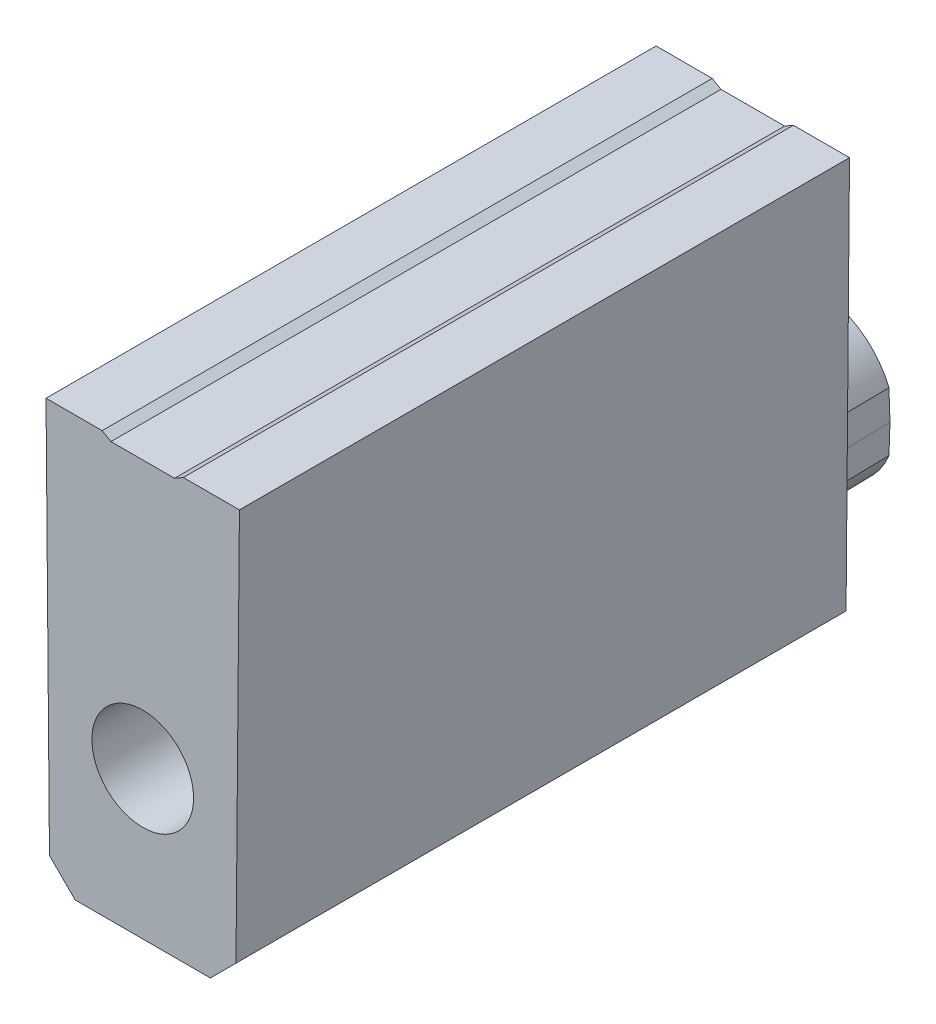
ISO-10303-21;
HEADER;
FILE_DESCRIPTION(('STEP AP214'),'2;1');
FILE_NAME('part.step','',(''),(''),'','','');
FILE_SCHEMA(('AUTOMOTIVE_DESIGN { 1 0 10303 214 1 1 1 1 }'));
ENDSEC;
DATA;
#1=APPLICATION_CONTEXT('core data for automotive mechanical design processes');
#2=APPLICATION_PROTOCOL_DEFINITION('international standard','automotive_design',2000,#1);
#3=PRODUCT_CONTEXT('',#1,'mechanical');
#4=PRODUCT('Part','Part','',(#3));
#5=PRODUCT_RELATED_PRODUCT_CATEGORY('part','',(#4));
#6=PRODUCT_DEFINITION_FORMATION('','',#4);
#7=PRODUCT_DEFINITION_CONTEXT('part definition',#1,'design');
#8=PRODUCT_DEFINITION('design','',#6,#7);
#9=PRODUCT_DEFINITION_SHAPE('','',#8);
#10=(LENGTH_UNIT() NAMED_UNIT(*) SI_UNIT(.MILLI.,.METRE.));
#11=(NAMED_UNIT(*) PLANE_ANGLE_UNIT() SI_UNIT($,.RADIAN.));
#12=(NAMED_UNIT(*) SI_UNIT($,.STERADIAN.) SOLID_ANGLE_UNIT());
#13=UNCERTAINTY_MEASURE_WITH_UNIT(LENGTH_MEASURE(1.E-05),#10,'distance_accuracy_value','');
#14=(GEOMETRIC_REPRESENTATION_CONTEXT(3) GLOBAL_UNCERTAINTY_ASSIGNED_CONTEXT((#13)) GLOBAL_UNIT_ASSIGNED_CONTEXT((#10,
#11,#12)) REPRESENTATION_CONTEXT('',''));
#15=CARTESIAN_POINT('',(0.,0.,0.));
#16=DIRECTION('',(0.,0.,1.));
#17=DIRECTION('',(1.,0.,0.));
#18=AXIS2_PLACEMENT_3D('',#15,#16,#17);
#19=CARTESIAN_POINT('',(2.41564658849859,10.4902,15.24));
#20=DIRECTION('',(0.,-1.,0.));
#21=DIRECTION('',(0.,0.,-1.));
#22=AXIS2_PLACEMENT_3D('',#19,#20,#21);
#23=PLANE('',#22);
#24=DIRECTION('',(-1.,0.,0.));
#25=VECTOR('',#24,1.);
#26=CARTESIAN_POINT('',(2.41564658849859,10.4902,15.24));
#27=LINE('',#26,#25);
#28=CARTESIAN_POINT('',(-1.01372045256125,10.4902,15.24));
#29=VERTEX_POINT('',#28);
#30=CARTESIAN_POINT('',(-2.41564658849859,10.4902,15.24));
#31=VERTEX_POINT('',#30);
#32=EDGE_CURVE('E180',#29,#31,#27,.T.);
#33=ORIENTED_EDGE('',*,*,#32,.F.);
#34=DIRECTION('',(0.,0.,-1.));
#35=VECTOR('',#34,1.);
#36=CARTESIAN_POINT('',(-1.01372045256125,10.4902,15.24));
#37=LINE('',#36,#35);
#38=CARTESIAN_POINT('',(-1.01372045256125,10.4902,0.));
#39=VERTEX_POINT('',#38);
#40=EDGE_CURVE('E239',#29,#39,#37,.T.);
#41=ORIENTED_EDGE('',*,*,#40,.T.);
#42=DIRECTION('',(-1.,0.,0.));
#43=VECTOR('',#42,1.);
#44=CARTESIAN_POINT('',(2.41564658849859,10.4902,0.));
#45=LINE('',#44,#43);
#46=CARTESIAN_POINT('',(-2.41564658849859,10.4902,0.));
#47=VERTEX_POINT('',#46);
#48=EDGE_CURVE('E188',#39,#47,#45,.T.);
#49=ORIENTED_EDGE('',*,*,#48,.T.);
#50=DIRECTION('',(0.,0.,-1.));
#51=VECTOR('',#50,1.);
#52=CARTESIAN_POINT('',(-2.41564658849859,10.4902,15.24));
#53=LINE('',#52,#51);
#54=EDGE_CURVE('E55',#31,#47,#53,.T.);
#55=ORIENTED_EDGE('',*,*,#54,.F.);
#56=EDGE_LOOP('',(#33,#41,#49,#55));
#57=FACE_BOUND('',#56,.T.);
#58=ADVANCED_FACE('F47',(#57),#23,.F.);
#59=CARTESIAN_POINT('',(-2.3241,0.,0.));
#60=DIRECTION('',(0.,0.,1.));
#61=DIRECTION('',(1.,0.,0.));
#62=AXIS2_PLACEMENT_3D('',#59,#60,#61);
#63=PLANE('',#62);
#64=DIRECTION('',(1.,0.,0.));
#65=VECTOR('',#64,1.);
#66=CARTESIAN_POINT('',(-2.3241,0.,0.));
#67=LINE('',#66,#65);
#68=CARTESIAN_POINT('',(-1.6891,0.,0.));
#69=VERTEX_POINT('',#68);
#70=CARTESIAN_POINT('',(1.6891,0.,0.));
#71=VERTEX_POINT('',#70);
#72=EDGE_CURVE('E199',#69,#71,#67,.T.);
#73=ORIENTED_EDGE('',*,*,#72,.F.);
#74=DIRECTION('',(0.707106781186551,-0.707106781186544,0.));
#75=VECTOR('',#74,1.);
#76=CARTESIAN_POINT('',(-1.6891,0.,0.));
#77=LINE('',#76,#75);
#78=CARTESIAN_POINT('',(-2.32969034726865,0.640590347268641,0.));
#79=VERTEX_POINT('',#78);
#80=EDGE_CURVE('E166',#79,#69,#77,.T.);
#81=ORIENTED_EDGE('',*,*,#80,.F.);
#82=DIRECTION('',(0.00872653549837085,-0.999961923064171,0.));
#83=VECTOR('',#82,1.);
#84=CARTESIAN_POINT('',(-2.41564658849859,10.4902,0.));
#85=LINE('',#84,#83);
#86=EDGE_CURVE('E174',#47,#79,#85,.T.);
#87=ORIENTED_EDGE('',*,*,#86,.F.);
#88=ORIENTED_EDGE('',*,*,#48,.F.);
#89=DIRECTION('',(-0.866025403784439,0.499999999999999,0.));
#90=VECTOR('',#89,1.);
#91=CARTESIAN_POINT('',(-0.79375,10.3632,0.));
#92=LINE('',#91,#90);
#93=CARTESIAN_POINT('',(-0.79375,10.3632,0.));
#94=VERTEX_POINT('',#93);
#95=EDGE_CURVE('E227',#94,#39,#92,.T.);
#96=ORIENTED_EDGE('',*,*,#95,.F.);
#97=DIRECTION('',(-1.,0.,0.));
#98=VECTOR('',#97,1.);
#99=CARTESIAN_POINT('',(0.79375,10.3632,0.));
#100=LINE('',#99,#98);
#101=CARTESIAN_POINT('',(0.79375,10.3632,0.));
#102=VERTEX_POINT('',#101);
#103=EDGE_CURVE('E235',#102,#94,#100,.T.);
#104=ORIENTED_EDGE('',*,*,#103,.F.);
#105=DIRECTION('',(-0.866025403784439,-0.499999999999999,0.));
#106=VECTOR('',#105,1.);
#107=CARTESIAN_POINT('',(1.01372045256125,10.4902,0.));
#108=LINE('',#107,#106);
#109=CARTESIAN_POINT('',(1.01372045256125,10.4902,0.));
#110=VERTEX_POINT('',#109);
#111=EDGE_CURVE('E220',#110,#102,#108,.T.);
#112=ORIENTED_EDGE('',*,*,#111,.F.);
#113=CARTESIAN_POINT('',(2.41564658849859,10.4902,0.));
#114=VERTEX_POINT('',#113);
#115=EDGE_CURVE('E183',#114,#110,#45,.T.);
#116=ORIENTED_EDGE('',*,*,#115,.F.);
#117=DIRECTION('',(0.00872653549837085,0.999961923064171,0.));
#118=VECTOR('',#117,1.);
#119=CARTESIAN_POINT('',(2.3241,0.,0.));
#120=LINE('',#119,#118);
#121=CARTESIAN_POINT('',(2.32969034726865,0.640590347268641,0.));
#122=VERTEX_POINT('',#121);
#123=EDGE_CURVE('E202',#122,#114,#120,.T.);
#124=ORIENTED_EDGE('',*,*,#123,.F.);
#125=DIRECTION('',(0.707106781186551,0.707106781186544,0.));
#126=VECTOR('',#125,1.);
#127=CARTESIAN_POINT('',(1.6891,0.,0.));
#128=LINE('',#127,#126);
#129=EDGE_CURVE('E213',#71,#122,#128,.T.);
#130=ORIENTED_EDGE('',*,*,#129,.F.);
#131=EDGE_LOOP('',(#73,#81,#87,#88,#96,#104,#112,#116,#124,#130));
#132=FACE_BOUND('',#131,.T.);
#133=CARTESIAN_POINT('',(0.,3.683,0.));
#134=DIRECTION('',(0.,0.,-1.));
#135=DIRECTION('',(-1.,0.,0.));
#136=AXIS2_PLACEMENT_3D('',#133,#134,#135);
#137=CIRCLE('',#136,1.984375);
#138=CARTESIAN_POINT('',(-1.84104191125753,4.42347877864136,0.));
#139=VERTEX_POINT('',#138);
#140=CARTESIAN_POINT('',(1.84104191125753,4.42347877864136,0.));
#141=VERTEX_POINT('',#140);
#142=EDGE_CURVE('E253',#139,#141,#137,.T.);
#143=ORIENTED_EDGE('',*,*,#142,.F.);
#144=DIRECTION('',(0.0348994967024975,0.999390827019096,0.));
#145=VECTOR('',#144,1.);
#146=CARTESIAN_POINT('',(-1.84104191125753,4.42347877864136,0.));
#147=LINE('',#146,#145);
#148=CARTESIAN_POINT('',(-1.8669,3.683,0.));
#149=VERTEX_POINT('',#148);
#150=EDGE_CURVE('E268',#149,#139,#147,.T.);
#151=ORIENTED_EDGE('',*,*,#150,.F.);
#152=DIRECTION('',(-0.0348994967024975,0.999390827019096,0.));
#153=VECTOR('',#152,1.);
#154=CARTESIAN_POINT('',(-1.8669,3.683,0.));
#155=LINE('',#154,#153);
#156=CARTESIAN_POINT('',(-1.84104191125753,2.94252122135863,0.));
#157=VERTEX_POINT('',#156);
#158=EDGE_CURVE('E265',#157,#149,#155,.T.);
#159=ORIENTED_EDGE('',*,*,#158,.F.);
#160=CARTESIAN_POINT('',(0.,3.683,0.));
#161=DIRECTION('',(0.,0.,-1.));
#162=DIRECTION('',(-1.,0.,0.));
#163=AXIS2_PLACEMENT_3D('',#160,#161,#162);
#164=CIRCLE('',#163,1.984375);
#165=CARTESIAN_POINT('',(1.84104191125753,2.94252122135864,0.));
#166=VERTEX_POINT('',#165);
#167=EDGE_CURVE('E262',#166,#157,#164,.T.);
#168=ORIENTED_EDGE('',*,*,#167,.F.);
#169=DIRECTION('',(-0.0348994967025045,-0.999390827019096,0.));
#170=VECTOR('',#169,1.);
#171=CARTESIAN_POINT('',(1.8669,3.683,0.));
#172=LINE('',#171,#170);
#173=CARTESIAN_POINT('',(1.8669,3.683,0.));
#174=VERTEX_POINT('',#173);
#175=EDGE_CURVE('E259',#174,#166,#172,.T.);
#176=ORIENTED_EDGE('',*,*,#175,.F.);
#177=DIRECTION('',(0.0348994967025045,-0.999390827019096,0.));
#178=VECTOR('',#177,1.);
#179=CARTESIAN_POINT('',(1.84104191125753,4.42347877864136,0.));
#180=LINE('',#179,#178);
#181=EDGE_CURVE('E256',#141,#174,#180,.T.);
#182=ORIENTED_EDGE('',*,*,#181,.F.);
#183=EDGE_LOOP('',(#143,#151,#159,#168,#176,#182));
#184=FACE_BOUND('',#183,.T.);
#185=ADVANCED_FACE('F207',(#132,#184),#63,.F.);
#186=CARTESIAN_POINT('',(-2.41564658849859,10.4902,15.24));
#187=DIRECTION('',(0.999961923064171,0.00872653549837085,0.));
#188=DIRECTION('',(-0.00872653549837085,0.999961923064171,0.));
#189=AXIS2_PLACEMENT_3D('',#186,#187,#188);
#190=PLANE('',#189);
#191=ORIENTED_EDGE('',*,*,#86,.T.);
#192=DIRECTION('',(0.,0.,-1.));
#193=VECTOR('',#192,1.);
#194=CARTESIAN_POINT('',(-2.32969034726865,0.640590347268641,15.24));
#195=LINE('',#194,#193);
#196=CARTESIAN_POINT('',(-2.32969034726865,0.640590347268641,15.24));
#197=VERTEX_POINT('',#196);
#198=EDGE_CURVE('E161',#197,#79,#195,.T.);
#199=ORIENTED_EDGE('',*,*,#198,.F.);
#200=DIRECTION('',(0.00872653549837085,-0.999961923064171,0.));
#201=VECTOR('',#200,1.);
#202=CARTESIAN_POINT('',(-2.41564658849859,10.4902,15.24));
#203=LINE('',#202,#201);
#204=EDGE_CURVE('E172',#31,#197,#203,.T.);
#205=ORIENTED_EDGE('',*,*,#204,.F.);
#206=ORIENTED_EDGE('',*,*,#54,.T.);
#207=EDGE_LOOP('',(#191,#199,#205,#206));
#208=FACE_BOUND('',#207,.T.);
#209=ADVANCED_FACE('F49',(#208),#190,.F.);
#210=CARTESIAN_POINT('',(-2.3241,0.,15.24));
#211=DIRECTION('',(0.,1.,0.));
#212=DIRECTION('',(0.,0.,1.));
#213=AXIS2_PLACEMENT_3D('',#210,#211,#212);
#214=PLANE('',#213);
#215=DIRECTION('',(1.,0.,0.));
#216=VECTOR('',#215,1.);
#217=CARTESIAN_POINT('',(-2.3241,0.,15.24));
#218=LINE('',#217,#216);
#219=CARTESIAN_POINT('',(-1.6891,0.,15.24));
#220=VERTEX_POINT('',#219);
#221=CARTESIAN_POINT('',(1.6891,0.,15.24));
#222=VERTEX_POINT('',#221);
#223=EDGE_CURVE('E182',#220,#222,#218,.T.);
#224=ORIENTED_EDGE('',*,*,#223,.F.);
#225=DIRECTION('',(0.,0.,-1.));
#226=VECTOR('',#225,1.);
#227=CARTESIAN_POINT('',(-1.6891,0.,15.24));
#228=LINE('',#227,#226);
#229=EDGE_CURVE('E62',#220,#69,#228,.T.);
#230=ORIENTED_EDGE('',*,*,#229,.T.);
#231=ORIENTED_EDGE('',*,*,#72,.T.);
#232=DIRECTION('',(0.,0.,-1.));
#233=VECTOR('',#232,1.);
#234=CARTESIAN_POINT('',(1.6891,0.,15.24));
#235=LINE('',#234,#233);
#236=EDGE_CURVE('E217',#222,#71,#235,.T.);
#237=ORIENTED_EDGE('',*,*,#236,.F.);
#238=EDGE_LOOP('',(#224,#230,#231,#237));
#239=FACE_BOUND('',#238,.T.);
#240=ADVANCED_FACE('F342',(#239),#214,.F.);
#241=CARTESIAN_POINT('',(2.3241,0.,15.24));
#242=DIRECTION('',(-0.999961923064171,0.00872653549837085,0.));
#243=DIRECTION('',(-0.00872653549837085,-0.999961923064171,0.));
#244=AXIS2_PLACEMENT_3D('',#241,#242,#243);
#245=PLANE('',#244);
#246=DIRECTION('',(0.00872653549837085,0.999961923064171,0.));
#247=VECTOR('',#246,1.);
#248=CARTESIAN_POINT('',(2.3241,0.,15.24));
#249=LINE('',#248,#247);
#250=CARTESIAN_POINT('',(2.32969034726865,0.640590347268642,15.24));
#251=VERTEX_POINT('',#250);
#252=CARTESIAN_POINT('',(2.41564658849859,10.4902,15.24));
#253=VERTEX_POINT('',#252);
#254=EDGE_CURVE('E185',#251,#253,#249,.T.);
#255=ORIENTED_EDGE('',*,*,#254,.F.);
#256=DIRECTION('',(0.,0.,-1.));
#257=VECTOR('',#256,1.);
#258=CARTESIAN_POINT('',(2.32969034726865,0.640590347268641,15.24));
#259=LINE('',#258,#257);
#260=EDGE_CURVE('E70',#251,#122,#259,.T.);
#261=ORIENTED_EDGE('',*,*,#260,.T.);
#262=ORIENTED_EDGE('',*,*,#123,.T.);
#263=DIRECTION('',(0.,0.,-1.));
#264=VECTOR('',#263,1.);
#265=CARTESIAN_POINT('',(2.41564658849859,10.4902,15.24));
#266=LINE('',#265,#264);
#267=EDGE_CURVE('E12',#253,#114,#266,.T.);
#268=ORIENTED_EDGE('',*,*,#267,.F.);
#269=EDGE_LOOP('',(#255,#261,#262,#268));
#270=FACE_BOUND('',#269,.T.);
#271=ADVANCED_FACE('F339',(#270),#245,.F.);
#272=ORIENTED_EDGE('',*,*,#115,.T.);
#273=DIRECTION('',(0.,0.,-1.));
#274=VECTOR('',#273,1.);
#275=CARTESIAN_POINT('',(1.01372045256125,10.4902,15.24));
#276=LINE('',#275,#274);
#277=CARTESIAN_POINT('',(1.01372045256125,10.4902,15.24));
#278=VERTEX_POINT('',#277);
#279=EDGE_CURVE('E232',#278,#110,#276,.T.);
#280=ORIENTED_EDGE('',*,*,#279,.F.);
#281=EDGE_CURVE('E195',#253,#278,#27,.T.);
#282=ORIENTED_EDGE('',*,*,#281,.F.);
#283=ORIENTED_EDGE('',*,*,#267,.T.);
#284=EDGE_LOOP('',(#272,#280,#282,#283));
#285=FACE_BOUND('',#284,.T.);
#286=ADVANCED_FACE('F334',(#285),#23,.F.);
#287=CARTESIAN_POINT('',(-2.3241,0.,15.24));
#288=DIRECTION('',(0.,0.,1.));
#289=DIRECTION('',(1.,0.,0.));
#290=AXIS2_PLACEMENT_3D('',#287,#288,#289);
#291=PLANE('',#290);
#292=DIRECTION('',(0.707106781186551,-0.707106781186544,0.));
#293=VECTOR('',#292,1.);
#294=CARTESIAN_POINT('',(-1.6891,0.,15.24));
#295=LINE('',#294,#293);
#296=EDGE_CURVE('E158',#197,#220,#295,.T.);
#297=ORIENTED_EDGE('',*,*,#296,.T.);
#298=ORIENTED_EDGE('',*,*,#223,.T.);
#299=DIRECTION('',(0.707106781186551,0.707106781186544,0.));
#300=VECTOR('',#299,1.);
#301=CARTESIAN_POINT('',(1.6891,0.,15.24));
#302=LINE('',#301,#300);
#303=EDGE_CURVE('E215',#222,#251,#302,.T.);
#304=ORIENTED_EDGE('',*,*,#303,.T.);
#305=ORIENTED_EDGE('',*,*,#254,.T.);
#306=ORIENTED_EDGE('',*,*,#281,.T.);
#307=DIRECTION('',(-0.866025403784439,-0.499999999999999,0.));
#308=VECTOR('',#307,1.);
#309=CARTESIAN_POINT('',(1.01372045256125,10.4902,15.24));
#310=LINE('',#309,#308);
#311=CARTESIAN_POINT('',(0.793749999999999,10.3632,15.24));
#312=VERTEX_POINT('',#311);
#313=EDGE_CURVE('E223',#278,#312,#310,.T.);
#314=ORIENTED_EDGE('',*,*,#313,.T.);
#315=DIRECTION('',(-1.,0.,0.));
#316=VECTOR('',#315,1.);
#317=CARTESIAN_POINT('',(0.79375,10.3632,15.24));
#318=LINE('',#317,#316);
#319=CARTESIAN_POINT('',(-0.79375,10.3632,15.24));
#320=VERTEX_POINT('',#319);
#321=EDGE_CURVE('E226',#312,#320,#318,.T.);
#322=ORIENTED_EDGE('',*,*,#321,.T.);
#323=DIRECTION('',(-0.866025403784439,0.499999999999999,0.));
#324=VECTOR('',#323,1.);
#325=CARTESIAN_POINT('',(-0.79375,10.3632,15.24));
#326=LINE('',#325,#324);
#327=EDGE_CURVE('E230',#320,#29,#326,.T.);
#328=ORIENTED_EDGE('',*,*,#327,.T.);
#329=ORIENTED_EDGE('',*,*,#32,.T.);
#330=ORIENTED_EDGE('',*,*,#204,.T.);
#331=EDGE_LOOP('',(#297,#298,#304,#305,#306,#314,#322,#328,#329,#330));
#332=FACE_BOUND('',#331,.T.);
#333=CARTESIAN_POINT('',(0.,3.683,15.24));
#334=DIRECTION('',(0.,0.,1.));
#335=DIRECTION('',(1.,0.,0.));
#336=AXIS2_PLACEMENT_3D('',#333,#334,#335);
#337=CIRCLE('',#336,1.27);
#338=CARTESIAN_POINT('',(1.27,3.683,15.24));
#339=VERTEX_POINT('',#338);
#340=EDGE_CURVE('E242',#339,#339,#337,.T.);
#341=ORIENTED_EDGE('',*,*,#340,.F.);
#342=EDGE_LOOP('',(#341));
#343=FACE_BOUND('',#342,.T.);
#344=ADVANCED_FACE('F176',(#332,#343),#291,.T.);
#345=CARTESIAN_POINT('',(0.,3.683,0.));
#346=DIRECTION('',(0.,0.,1.));
#347=DIRECTION('',(-1.,0.,0.));
#348=AXIS2_PLACEMENT_3D('',#345,#346,#347);
#349=CONICAL_SURFACE('',#348,1.984375,0.0174532925199433);
#350=ORIENTED_EDGE('',*,*,#142,.T.);
#351=CARTESIAN_POINT('',(1.81351922983038,4.41763341582656,-1.5875));
#352=CARTESIAN_POINT('',(1.81810624033087,4.41861058998758,-1.32291667573096));
#353=CARTESIAN_POINT('',(1.82269330236671,4.41958629063599,-1.05833334692974));
#354=CARTESIAN_POINT('',(1.8318675295091,4.42153474490759,-0.52916668026307));
#355=CARTESIAN_POINT('',(1.83645469461564,4.42250749853078,-0.264583342397622));
#356=CARTESIAN_POINT('',(1.84104191125753,4.42347877864136,0.));
#357=B_SPLINE_CURVE_WITH_KNOTS('',3,(#351,#352,#353,#354,#355,#356),.UNSPECIFIED.,.F.,.F.,(4,2,
4),(0.,0.793874662074993,1.58774932414964),.UNSPECIFIED.);
#358=CARTESIAN_POINT('',(1.81351922983038,4.41763341582656,-1.5875));
#359=VERTEX_POINT('',#358);
#360=EDGE_CURVE('E200',#359,#141,#357,.T.);
#361=ORIENTED_EDGE('',*,*,#360,.F.);
#362=CARTESIAN_POINT('',(0.,3.683,-1.5875));
#363=DIRECTION('',(0.,0.,-1.));
#364=DIRECTION('',(-1.,0.,0.));
#365=AXIS2_PLACEMENT_3D('',#362,#363,#364);
#366=CIRCLE('',#365,1.95666508442645);
#367=CARTESIAN_POINT('',(-1.81351922983038,4.41763341582656,-1.5875));
#368=VERTEX_POINT('',#367);
#369=EDGE_CURVE('E271',#368,#359,#366,.T.);
#370=ORIENTED_EDGE('',*,*,#369,.F.);
#371=CARTESIAN_POINT('',(-1.81351922983038,4.41763341582656,-1.5875));
#372=CARTESIAN_POINT('',(-1.81810624033087,4.41861058998758,-1.32291667573096));
#373=CARTESIAN_POINT('',(-1.82269330236671,4.41958629063599,-1.05833334692974));
#374=CARTESIAN_POINT('',(-1.8318675295091,4.42153474490759,-0.52916668026307));
#375=CARTESIAN_POINT('',(-1.83645469461564,4.42250749853078,-0.264583342397622));
#376=CARTESIAN_POINT('',(-1.84104191125753,4.42347877864136,0.));
#377=B_SPLINE_CURVE_WITH_KNOTS('',3,(#371,#372,#373,#374,#375,#376),.UNSPECIFIED.,.F.,.F.,(4,2,
4),(0.,0.793874662074993,1.58774932414964),.UNSPECIFIED.);
#378=EDGE_CURVE('E281',#368,#139,#377,.T.);
#379=ORIENTED_EDGE('',*,*,#378,.T.);
#380=EDGE_LOOP('',(#350,#361,#370,#379));
#381=FACE_BOUND('',#380,.T.);
#382=ADVANCED_FACE('F291',(#381),#349,.T.);
#383=CARTESIAN_POINT('',(1.84104191125753,4.42347877864136,0.));
#384=DIRECTION('',(0.999238614955482,0.0348941813401172,-0.0174524064372835));
#385=DIRECTION('',(-0.0348994967025045,0.999390827019096,0.));
#386=AXIS2_PLACEMENT_3D('',#383,#384,#385);
#387=PLANE('',#386);
#388=ORIENTED_EDGE('',*,*,#181,.T.);
#389=DIRECTION('',(0.0174630412089702,0.,0.999847509469186));
#390=VECTOR('',#389,1.);
#391=CARTESIAN_POINT('',(1.8669,3.683,0.));
#392=LINE('',#391,#390);
#393=CARTESIAN_POINT('',(1.8391731940054,3.683,-1.5875));
#394=VERTEX_POINT('',#393);
#395=EDGE_CURVE('E280',#394,#174,#392,.T.);
#396=ORIENTED_EDGE('',*,*,#395,.F.);
#397=DIRECTION('',(-0.0348994967025045,0.999390827019096,0.));
#398=VECTOR('',#397,1.);
#399=CARTESIAN_POINT('',(1.81334887581586,4.42251171653418,-1.5875));
#400=LINE('',#399,#398);
#401=EDGE_CURVE('E397',#359,#394,#400,.F.);
#402=ORIENTED_EDGE('',*,*,#401,.F.);
#403=ORIENTED_EDGE('',*,*,#360,.T.);
#404=EDGE_LOOP('',(#388,#396,#402,#403));
#405=FACE_BOUND('',#404,.T.);
#406=ADVANCED_FACE('F288',(#405),#387,.T.);
#407=CARTESIAN_POINT('',(1.8669,3.683,0.));
#408=DIRECTION('',(0.999238614955482,-0.0348941813401172,-0.0174524064372835));
#409=DIRECTION('',(0.0348994967025045,0.999390827019096,0.));
#410=AXIS2_PLACEMENT_3D('',#407,#408,#409);
#411=PLANE('',#410);
#412=ORIENTED_EDGE('',*,*,#175,.T.);
#413=CARTESIAN_POINT('',(1.81351922983038,2.94836658417344,-1.5875));
#414=CARTESIAN_POINT('',(1.81810624033087,2.94738941001242,-1.32291667573096));
#415=CARTESIAN_POINT('',(1.82269330236671,2.94641370936401,-1.05833334692974));
#416=CARTESIAN_POINT('',(1.8318675295091,2.94446525509241,-0.52916668026307));
#417=CARTESIAN_POINT('',(1.83645469461564,2.94349250146922,-0.264583342397622));
#418=CARTESIAN_POINT('',(1.84104191125753,2.94252122135864,0.));
#419=B_SPLINE_CURVE_WITH_KNOTS('',3,(#413,#414,#415,#416,#417,#418),.UNSPECIFIED.,.F.,.F.,(4,2,
4),(0.,0.793874662074993,1.58774932414964),.UNSPECIFIED.);
#420=CARTESIAN_POINT('',(1.81351922983038,2.94836658417344,-1.5875));
#421=VERTEX_POINT('',#420);
#422=EDGE_CURVE('E318',#421,#166,#419,.T.);
#423=ORIENTED_EDGE('',*,*,#422,.F.);
#424=DIRECTION('',(0.0348994967025045,0.999390827019096,0.));
#425=VECTOR('',#424,1.);
#426=CARTESIAN_POINT('',(1.83920696455833,3.68396706210719,-1.5875));
#427=LINE('',#426,#425);
#428=EDGE_CURVE('E405',#394,#421,#427,.F.);
#429=ORIENTED_EDGE('',*,*,#428,.F.);
#430=ORIENTED_EDGE('',*,*,#395,.T.);
#431=EDGE_LOOP('',(#412,#423,#429,#430));
#432=FACE_BOUND('',#431,.T.);
#433=ADVANCED_FACE('F327',(#432),#411,.T.);
#434=CARTESIAN_POINT('',(0.,3.683,0.));
#435=DIRECTION('',(0.,0.,1.));
#436=DIRECTION('',(-1.,0.,0.));
#437=AXIS2_PLACEMENT_3D('',#434,#435,#436);
#438=CONICAL_SURFACE('',#437,1.984375,0.0174532925199433);
#439=ORIENTED_EDGE('',*,*,#167,.T.);
#440=CARTESIAN_POINT('',(-1.81351922983038,2.94836658417344,-1.5875));
#441=CARTESIAN_POINT('',(-1.81810624033087,2.94738941001242,-1.32291667573096));
#442=CARTESIAN_POINT('',(-1.82269330236671,2.94641370936401,-1.05833334692974));
#443=CARTESIAN_POINT('',(-1.8318675295091,2.94446525509241,-0.52916668026307));
#444=CARTESIAN_POINT('',(-1.83645469461564,2.94349250146922,-0.264583342397622));
#445=CARTESIAN_POINT('',(-1.84104191125753,2.94252122135864,0.));
#446=B_SPLINE_CURVE_WITH_KNOTS('',3,(#440,#441,#442,#443,#444,#445),.UNSPECIFIED.,.F.,.F.,(4,2,
4),(0.,0.793874662074993,1.58774932414964),.UNSPECIFIED.);
#447=CARTESIAN_POINT('',(-1.81351922983038,2.94836658417344,-1.5875));
#448=VERTEX_POINT('',#447);
#449=EDGE_CURVE('E311',#448,#157,#446,.T.);
#450=ORIENTED_EDGE('',*,*,#449,.F.);
#451=CARTESIAN_POINT('',(0.,3.683,-1.5875));
#452=DIRECTION('',(0.,0.,-1.));
#453=DIRECTION('',(-1.,0.,0.));
#454=AXIS2_PLACEMENT_3D('',#451,#452,#453);
#455=CIRCLE('',#454,1.95666508442645);
#456=EDGE_CURVE('E407',#421,#448,#455,.T.);
#457=ORIENTED_EDGE('',*,*,#456,.F.);
#458=ORIENTED_EDGE('',*,*,#422,.T.);
#459=EDGE_LOOP('',(#439,#450,#457,#458));
#460=FACE_BOUND('',#459,.T.);
#461=ADVANCED_FACE('F306',(#460),#438,.T.);
#462=CARTESIAN_POINT('',(-1.8669,3.683,0.));
#463=DIRECTION('',(-0.999238614955483,-0.0348941813401102,-0.0174524064372835));
#464=DIRECTION('',(0.0348994967024975,-0.999390827019096,0.));
#465=AXIS2_PLACEMENT_3D('',#462,#463,#464);
#466=PLANE('',#465);
#467=ORIENTED_EDGE('',*,*,#158,.T.);
#468=DIRECTION('',(-0.0174630412089702,0.,0.999847509469186));
#469=VECTOR('',#468,1.);
#470=CARTESIAN_POINT('',(-1.86689211437393,3.683,-0.000451492010538194));
#471=LINE('',#470,#469);
#472=CARTESIAN_POINT('',(-1.83917319400539,3.683,-1.5875));
#473=VERTEX_POINT('',#472);
#474=EDGE_CURVE('E319',#473,#149,#471,.T.);
#475=ORIENTED_EDGE('',*,*,#474,.F.);
#476=DIRECTION('',(0.0348994967024975,-0.999390827019096,0.));
#477=VECTOR('',#476,1.);
#478=CARTESIAN_POINT('',(-1.83920696455832,3.68396706210719,-1.5875));
#479=LINE('',#478,#477);
#480=EDGE_CURVE('E410',#448,#473,#479,.F.);
#481=ORIENTED_EDGE('',*,*,#480,.F.);
#482=ORIENTED_EDGE('',*,*,#449,.T.);
#483=EDGE_LOOP('',(#467,#475,#481,#482));
#484=FACE_BOUND('',#483,.T.);
#485=ADVANCED_FACE('F301',(#484),#466,.T.);
#486=CARTESIAN_POINT('',(-1.84104191125753,4.42347877864136,0.));
#487=DIRECTION('',(-0.999238614955483,0.0348941813401102,-0.0174524064372835));
#488=DIRECTION('',(-0.0348994967024975,-0.999390827019096,0.));
#489=AXIS2_PLACEMENT_3D('',#486,#487,#488);
#490=PLANE('',#489);
#491=ORIENTED_EDGE('',*,*,#150,.T.);
#492=ORIENTED_EDGE('',*,*,#378,.F.);
#493=DIRECTION('',(-0.0348994967024975,-0.999390827019096,0.));
#494=VECTOR('',#493,1.);
#495=CARTESIAN_POINT('',(-1.81334887581586,4.42251171653418,-1.5875));
#496=LINE('',#495,#494);
#497=EDGE_CURVE('E191',#473,#368,#496,.F.);
#498=ORIENTED_EDGE('',*,*,#497,.F.);
#499=ORIENTED_EDGE('',*,*,#474,.T.);
#500=EDGE_LOOP('',(#491,#492,#498,#499));
#501=FACE_BOUND('',#500,.T.);
#502=ADVANCED_FACE('F295',(#501),#490,.T.);
#503=CARTESIAN_POINT('',(0.,3.683,-1.5875));
#504=DIRECTION('',(0.,0.,-1.));
#505=DIRECTION('',(-1.,0.,0.));
#506=AXIS2_PLACEMENT_3D('',#503,#504,#505);
#507=PLANE('',#506);
#508=ORIENTED_EDGE('',*,*,#369,.T.);
#509=ORIENTED_EDGE('',*,*,#401,.T.);
#510=ORIENTED_EDGE('',*,*,#428,.T.);
#511=ORIENTED_EDGE('',*,*,#456,.T.);
#512=ORIENTED_EDGE('',*,*,#480,.T.);
#513=ORIENTED_EDGE('',*,*,#497,.T.);
#514=EDGE_LOOP('',(#508,#509,#510,#511,#512,#513));
#515=FACE_BOUND('',#514,.T.);
#516=ADVANCED_FACE('F300',(#515),#507,.T.);
#517=CARTESIAN_POINT('',(0.,3.683,15.24));
#518=DIRECTION('',(0.,0.,1.));
#519=DIRECTION('',(1.,0.,0.));
#520=AXIS2_PLACEMENT_3D('',#517,#518,#519);
#521=CONICAL_SURFACE('',#520,1.27,0.00872664625997167);
#522=CARTESIAN_POINT('',(0.,3.683,6.35));
#523=DIRECTION('',(0.,0.,1.));
#524=DIRECTION('',(1.,0.,0.));
#525=AXIS2_PLACEMENT_3D('',#522,#523,#524);
#526=CIRCLE('',#525,1.19241814534015);
#527=CARTESIAN_POINT('',(1.19241814534015,3.683,6.35));
#528=VERTEX_POINT('',#527);
#529=EDGE_CURVE('E250',#528,#528,#526,.T.);
#530=ORIENTED_EDGE('',*,*,#529,.F.);
#531=EDGE_LOOP('',(#530));
#532=FACE_BOUND('',#531,.T.);
#533=ORIENTED_EDGE('',*,*,#340,.T.);
#534=EDGE_LOOP('',(#533));
#535=FACE_BOUND('',#534,.T.);
#536=ADVANCED_FACE('F386',(#532,#535),#521,.F.);
#537=CARTESIAN_POINT('',(0.,3.683,6.35));
#538=DIRECTION('',(0.,0.,1.));
#539=DIRECTION('',(1.,0.,0.));
#540=AXIS2_PLACEMENT_3D('',#537,#538,#539);
#541=PLANE('',#540);
#542=ORIENTED_EDGE('',*,*,#529,.T.);
#543=EDGE_LOOP('',(#542));
#544=FACE_BOUND('',#543,.T.);
#545=ADVANCED_FACE('F381',(#544),#541,.T.);
#546=CARTESIAN_POINT('',(-0.79375,10.3632,15.24));
#547=DIRECTION('',(-0.499999999999999,-0.866025403784439,0.));
#548=DIRECTION('',(0.866025403784439,-0.499999999999999,0.));
#549=AXIS2_PLACEMENT_3D('',#546,#547,#548);
#550=PLANE('',#549);
#551=ORIENTED_EDGE('',*,*,#95,.T.);
#552=ORIENTED_EDGE('',*,*,#40,.F.);
#553=ORIENTED_EDGE('',*,*,#327,.F.);
#554=DIRECTION('',(0.,0.,-1.));
#555=VECTOR('',#554,1.);
#556=CARTESIAN_POINT('',(-0.79375,10.3632,15.24));
#557=LINE('',#556,#555);
#558=EDGE_CURVE('E243',#320,#94,#557,.T.);
#559=ORIENTED_EDGE('',*,*,#558,.T.);
#560=EDGE_LOOP('',(#551,#552,#553,#559));
#561=FACE_BOUND('',#560,.T.);
#562=ADVANCED_FACE('F354',(#561),#550,.F.);
#563=CARTESIAN_POINT('',(0.79375,10.3632,15.24));
#564=DIRECTION('',(0.,-1.,0.));
#565=DIRECTION('',(0.,0.,-1.));
#566=AXIS2_PLACEMENT_3D('',#563,#564,#565);
#567=PLANE('',#566);
#568=ORIENTED_EDGE('',*,*,#103,.T.);
#569=ORIENTED_EDGE('',*,*,#558,.F.);
#570=ORIENTED_EDGE('',*,*,#321,.F.);
#571=DIRECTION('',(0.,0.,-1.));
#572=VECTOR('',#571,1.);
#573=CARTESIAN_POINT('',(0.79375,10.3632,15.24));
#574=LINE('',#573,#572);
#575=EDGE_CURVE('E245',#312,#102,#574,.T.);
#576=ORIENTED_EDGE('',*,*,#575,.T.);
#577=EDGE_LOOP('',(#568,#569,#570,#576));
#578=FACE_BOUND('',#577,.T.);
#579=ADVANCED_FACE('F357',(#578),#567,.F.);
#580=CARTESIAN_POINT('',(1.01372045256125,10.4902,15.24));
#581=DIRECTION('',(0.499999999999999,-0.866025403784439,0.));
#582=DIRECTION('',(0.866025403784439,0.499999999999999,0.));
#583=AXIS2_PLACEMENT_3D('',#580,#581,#582);
#584=PLANE('',#583);
#585=ORIENTED_EDGE('',*,*,#111,.T.);
#586=ORIENTED_EDGE('',*,*,#575,.F.);
#587=ORIENTED_EDGE('',*,*,#313,.F.);
#588=ORIENTED_EDGE('',*,*,#279,.T.);
#589=EDGE_LOOP('',(#585,#586,#587,#588));
#590=FACE_BOUND('',#589,.T.);
#591=ADVANCED_FACE('F359',(#590),#584,.F.);
#592=CARTESIAN_POINT('',(1.6891,0.,15.24));
#593=DIRECTION('',(-0.707106781186544,0.707106781186551,0.));
#594=DIRECTION('',(-0.707106781186551,-0.707106781186544,0.));
#595=AXIS2_PLACEMENT_3D('',#592,#593,#594);
#596=PLANE('',#595);
#597=ORIENTED_EDGE('',*,*,#129,.T.);
#598=ORIENTED_EDGE('',*,*,#260,.F.);
#599=ORIENTED_EDGE('',*,*,#303,.F.);
#600=ORIENTED_EDGE('',*,*,#236,.T.);
#601=EDGE_LOOP('',(#597,#598,#599,#600));
#602=FACE_BOUND('',#601,.T.);
#603=ADVANCED_FACE('F368',(#602),#596,.F.);
#604=CARTESIAN_POINT('',(-1.6891,0.,15.24));
#605=DIRECTION('',(0.707106781186544,0.707106781186551,0.));
#606=DIRECTION('',(-0.707106781186551,0.707106781186544,0.));
#607=AXIS2_PLACEMENT_3D('',#604,#605,#606);
#608=PLANE('',#607);
#609=ORIENTED_EDGE('',*,*,#80,.T.);
#610=ORIENTED_EDGE('',*,*,#229,.F.);
#611=ORIENTED_EDGE('',*,*,#296,.F.);
#612=ORIENTED_EDGE('',*,*,#198,.T.);
#613=EDGE_LOOP('',(#609,#610,#611,#612));
#614=FACE_BOUND('',#613,.T.);
#615=ADVANCED_FACE('F160',(#614),#608,.F.);
#616=CLOSED_SHELL('',(#58,#185,#209,#240,#271,#286,#344,#382,#406,#433,#461,#485,#502,#516,#536,
#545,#562,#579,#591,#603,#615));
#617=MANIFOLD_SOLID_BREP('B2',#616);
#618=ADVANCED_BREP_SHAPE_REPRESENTATION('',(#18,#617),#14);
#619=SHAPE_DEFINITION_REPRESENTATION(#9,#618);
ENDSEC;
END-ISO-10303-21;
